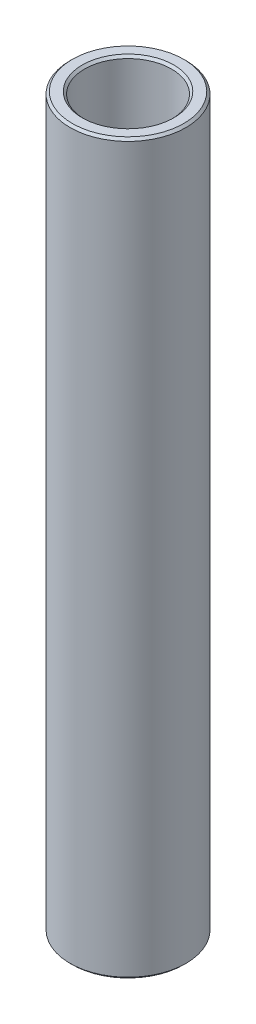
ISO-10303-21;
HEADER;
FILE_DESCRIPTION(('STEP AP214'),'2;1');
FILE_NAME('part.step','',(''),(''),'','','');
FILE_SCHEMA(('AUTOMOTIVE_DESIGN { 1 0 10303 214 1 1 1 1 }'));
ENDSEC;
DATA;
#1=APPLICATION_CONTEXT('core data for automotive mechanical design processes');
#2=APPLICATION_PROTOCOL_DEFINITION('international standard','automotive_design',2000,#1);
#3=PRODUCT_CONTEXT('',#1,'mechanical');
#4=PRODUCT('Part','Part','',(#3));
#5=PRODUCT_RELATED_PRODUCT_CATEGORY('part','',(#4));
#6=PRODUCT_DEFINITION_FORMATION('','',#4);
#7=PRODUCT_DEFINITION_CONTEXT('part definition',#1,'design');
#8=PRODUCT_DEFINITION('design','',#6,#7);
#9=PRODUCT_DEFINITION_SHAPE('','',#8);
#10=(LENGTH_UNIT() NAMED_UNIT(*) SI_UNIT(.MILLI.,.METRE.));
#11=(NAMED_UNIT(*) PLANE_ANGLE_UNIT() SI_UNIT($,.RADIAN.));
#12=(NAMED_UNIT(*) SI_UNIT($,.STERADIAN.) SOLID_ANGLE_UNIT());
#13=UNCERTAINTY_MEASURE_WITH_UNIT(LENGTH_MEASURE(1.E-05),#10,'distance_accuracy_value','');
#14=(GEOMETRIC_REPRESENTATION_CONTEXT(3) GLOBAL_UNCERTAINTY_ASSIGNED_CONTEXT((#13)) GLOBAL_UNIT_ASSIGNED_CONTEXT((#10,
#11,#12)) REPRESENTATION_CONTEXT('',''));
#15=CARTESIAN_POINT('',(0.,0.,0.));
#16=DIRECTION('',(0.,0.,1.));
#17=DIRECTION('',(1.,0.,0.));
#18=AXIS2_PLACEMENT_3D('',#15,#16,#17);
#19=CARTESIAN_POINT('',(6.35000000000029,72.7023674642314,0.));
#20=DIRECTION('',(-2.53140539446084E-11,-1.,0.));
#21=DIRECTION('',(1.,-2.53140539446084E-11,0.));
#22=AXIS2_PLACEMENT_3D('',#19,#20,#21);
#23=PLANE('',#22);
#24=CARTESIAN_POINT('',(2.41116363825956E-10,72.7023674643922,0.));
#25=DIRECTION('',(-2.53140539446084E-11,-1.,0.));
#26=DIRECTION('',(1.,-2.53140539446084E-11,0.));
#27=AXIS2_PLACEMENT_3D('',#24,#25,#26);
#28=CIRCLE('',#27,5.0164999997388);
#29=CARTESIAN_POINT('',(5.01649999997992,72.7023674642652,0.));
#30=VERTEX_POINT('',#29);
#31=EDGE_CURVE('E10',#30,#30,#28,.F.);
#32=ORIENTED_EDGE('',*,*,#31,.T.);
#33=EDGE_LOOP('',(#32));
#34=FACE_BOUND('',#33,.T.);
#35=CARTESIAN_POINT('',(2.41116363825955E-10,72.7023674643922,0.));
#36=DIRECTION('',(-2.53140539446084E-11,-1.,0.));
#37=DIRECTION('',(1.,-2.53140539446084E-11,0.));
#38=AXIS2_PLACEMENT_3D('',#35,#36,#37);
#39=CIRCLE('',#38,6.09599999973907);
#40=CARTESIAN_POINT('',(6.09599999998018,72.7023674642379,0.));
#41=VERTEX_POINT('',#40);
#42=EDGE_CURVE('E37',#41,#41,#39,.T.);
#43=ORIENTED_EDGE('',*,*,#42,.T.);
#44=EDGE_LOOP('',(#43));
#45=FACE_BOUND('',#44,.T.);
#46=ADVANCED_FACE('F30',(#34,#45),#23,.T.);
#47=CARTESIAN_POINT('',(0.,63.1773674642515,0.));
#48=DIRECTION('',(-2.53140539446084E-11,-1.,0.));
#49=DIRECTION('',(1.,-2.53140539446084E-11,0.));
#50=AXIS2_PLACEMENT_3D('',#47,#48,#49);
#51=CYLINDRICAL_SURFACE('',#50,4.76249999874922);
#52=CARTESIAN_POINT('',(2.2540361411653E-09,152.220242465527,0.));
#53=DIRECTION('',(2.53140539446083E-11,1.,0.));
#54=DIRECTION('',(-1.,2.53140539446083E-11,0.));
#55=AXIS2_PLACEMENT_3D('',#52,#53,#54);
#56=CIRCLE('',#55,4.76249999874922);
#57=CARTESIAN_POINT('',(-4.76249999649519,152.220242465647,0.));
#58=VERTEX_POINT('',#57);
#59=EDGE_CURVE('E41',#58,#58,#56,.T.);
#60=ORIENTED_EDGE('',*,*,#59,.T.);
#61=EDGE_LOOP('',(#60));
#62=FACE_BOUND('',#61,.T.);
#63=CARTESIAN_POINT('',(2.47546133552937E-10,72.9563674653818,0.));
#64=DIRECTION('',(-2.53140539446084E-11,-1.,0.));
#65=DIRECTION('',(1.,-2.53140539446084E-11,0.));
#66=AXIS2_PLACEMENT_3D('',#63,#64,#65);
#67=CIRCLE('',#66,4.76249999874922);
#68=CARTESIAN_POINT('',(4.76249999899677,72.9563674652612,0.));
#69=VERTEX_POINT('',#68);
#70=EDGE_CURVE('E45',#69,#69,#67,.T.);
#71=ORIENTED_EDGE('',*,*,#70,.T.);
#72=EDGE_LOOP('',(#71));
#73=FACE_BOUND('',#72,.T.);
#74=ADVANCED_FACE('F74',(#62,#73),#51,.F.);
#75=CARTESIAN_POINT('',(4.76250000000001,152.474242464417,0.));
#76=DIRECTION('',(2.53140539446084E-11,1.,0.));
#77=DIRECTION('',(-1.,2.53140539446084E-11,0.));
#78=AXIS2_PLACEMENT_3D('',#75,#76,#77);
#79=PLANE('',#78);
#80=CARTESIAN_POINT('',(2.26046591084218E-09,152.474242464537,0.));
#81=DIRECTION('',(2.53140539446084E-11,1.,0.));
#82=DIRECTION('',(-1.,2.53140539446084E-11,0.));
#83=AXIS2_PLACEMENT_3D('',#80,#81,#82);
#84=CIRCLE('',#83,6.09599999775994);
#85=CARTESIAN_POINT('',(-6.09599999549948,152.474242464692,0.));
#86=VERTEX_POINT('',#85);
#87=EDGE_CURVE('E50',#86,#86,#84,.T.);
#88=ORIENTED_EDGE('',*,*,#87,.T.);
#89=EDGE_LOOP('',(#88));
#90=FACE_BOUND('',#89,.T.);
#91=CARTESIAN_POINT('',(2.26046591084218E-09,152.474242464537,0.));
#92=DIRECTION('',(2.53140539446084E-11,1.,0.));
#93=DIRECTION('',(-1.,2.53140539446084E-11,0.));
#94=AXIS2_PLACEMENT_3D('',#91,#92,#93);
#95=CIRCLE('',#94,5.01649999775964);
#96=CARTESIAN_POINT('',(-5.01649999549917,152.474242464664,0.));
#97=VERTEX_POINT('',#96);
#98=EDGE_CURVE('E53',#97,#97,#95,.F.);
#99=ORIENTED_EDGE('',*,*,#98,.T.);
#100=EDGE_LOOP('',(#99));
#101=FACE_BOUND('',#100,.T.);
#102=ADVANCED_FACE('F79',(#90,#101),#79,.T.);
#103=CARTESIAN_POINT('',(0.,63.1773674642515,0.));
#104=DIRECTION('',(-2.53140539446084E-11,-1.,0.));
#105=DIRECTION('',(1.,-2.53140539446084E-11,0.));
#106=AXIS2_PLACEMENT_3D('',#103,#104,#105);
#107=CYLINDRICAL_SURFACE('',#106,6.34999999874949);
#108=CARTESIAN_POINT('',(2.2540361411152E-09,152.220242463548,0.));
#109=DIRECTION('',(2.53140539446072E-11,1.,0.));
#110=DIRECTION('',(-1.,2.53140539446072E-11,0.));
#111=AXIS2_PLACEMENT_3D('',#108,#109,#110);
#112=CIRCLE('',#111,6.34999999874949);
#113=CARTESIAN_POINT('',(-6.34999999649546,152.220242463708,0.));
#114=VERTEX_POINT('',#113);
#115=EDGE_CURVE('E56',#114,#114,#112,.F.);
#116=ORIENTED_EDGE('',*,*,#115,.T.);
#117=EDGE_LOOP('',(#116));
#118=FACE_BOUND('',#117,.T.);
#119=CARTESIAN_POINT('',(2.47546133502836E-10,72.9563674634026,0.));
#120=DIRECTION('',(-2.53140539446084E-11,-1.,0.));
#121=DIRECTION('',(1.,-2.53140539446084E-11,0.));
#122=AXIS2_PLACEMENT_3D('',#119,#120,#121);
#123=CIRCLE('',#122,6.34999999874949);
#124=CARTESIAN_POINT('',(6.34999999899704,72.9563674632419,0.));
#125=VERTEX_POINT('',#124);
#126=EDGE_CURVE('E59',#125,#125,#123,.F.);
#127=ORIENTED_EDGE('',*,*,#126,.T.);
#128=EDGE_LOOP('',(#127));
#129=FACE_BOUND('',#128,.T.);
#130=ADVANCED_FACE('F63',(#118,#129),#107,.T.);
#131=CARTESIAN_POINT('',(2.2540361411152E-09,152.220242463548,0.));
#132=DIRECTION('',(-2.53140539446072E-11,-1.,0.));
#133=DIRECTION('',(1.,-2.53140539446072E-11,0.));
#134=AXIS2_PLACEMENT_3D('',#131,#132,#133);
#135=CONICAL_SURFACE('',#134,6.34999999874949,0.785398163397423);
#136=ORIENTED_EDGE('',*,*,#87,.F.);
#137=EDGE_LOOP('',(#136));
#138=FACE_BOUND('',#137,.T.);
#139=ORIENTED_EDGE('',*,*,#115,.F.);
#140=EDGE_LOOP('',(#139));
#141=FACE_BOUND('',#140,.T.);
#142=ADVANCED_FACE('F84',(#138,#141),#135,.T.);
#143=CARTESIAN_POINT('',(2.26046591084218E-09,152.474242464537,0.));
#144=DIRECTION('',(2.53140539446083E-11,1.,0.));
#145=DIRECTION('',(-1.,2.53140539446083E-11,0.));
#146=AXIS2_PLACEMENT_3D('',#143,#144,#145);
#147=CONICAL_SURFACE('',#146,5.01649999775965,0.785398163397431);
#148=ORIENTED_EDGE('',*,*,#59,.F.);
#149=EDGE_LOOP('',(#148));
#150=FACE_BOUND('',#149,.T.);
#151=ORIENTED_EDGE('',*,*,#98,.F.);
#152=EDGE_LOOP('',(#151));
#153=FACE_BOUND('',#152,.T.);
#154=ADVANCED_FACE('F71',(#150,#153),#147,.F.);
#155=CARTESIAN_POINT('',(2.47546133552937E-10,72.9563674653818,0.));
#156=DIRECTION('',(-2.53140539446084E-11,-1.,0.));
#157=DIRECTION('',(1.,-2.53140539446084E-11,0.));
#158=AXIS2_PLACEMENT_3D('',#155,#156,#157);
#159=CONICAL_SURFACE('',#158,4.76249999874922,0.785398163397399);
#160=ORIENTED_EDGE('',*,*,#31,.F.);
#161=EDGE_LOOP('',(#160));
#162=FACE_BOUND('',#161,.T.);
#163=ORIENTED_EDGE('',*,*,#70,.F.);
#164=EDGE_LOOP('',(#163));
#165=FACE_BOUND('',#164,.T.);
#166=ADVANCED_FACE('F67',(#162,#165),#159,.F.);
#167=CARTESIAN_POINT('',(2.41116363825955E-10,72.7023674643922,0.));
#168=DIRECTION('',(2.53140539446084E-11,1.,0.));
#169=DIRECTION('',(-1.,2.53140539446084E-11,0.));
#170=AXIS2_PLACEMENT_3D('',#167,#168,#169);
#171=CONICAL_SURFACE('',#170,6.09599999973907,0.785398163397457);
#172=ORIENTED_EDGE('',*,*,#126,.F.);
#173=EDGE_LOOP('',(#172));
#174=FACE_BOUND('',#173,.T.);
#175=ORIENTED_EDGE('',*,*,#42,.F.);
#176=EDGE_LOOP('',(#175));
#177=FACE_BOUND('',#176,.T.);
#178=ADVANCED_FACE('F32',(#174,#177),#171,.T.);
#179=CLOSED_SHELL('',(#46,#74,#102,#130,#142,#154,#166,#178));
#180=MANIFOLD_SOLID_BREP('B2',#179);
#181=ADVANCED_BREP_SHAPE_REPRESENTATION('',(#18,#180),#14);
#182=SHAPE_DEFINITION_REPRESENTATION(#9,#181);
ENDSEC;
END-ISO-10303-21;
